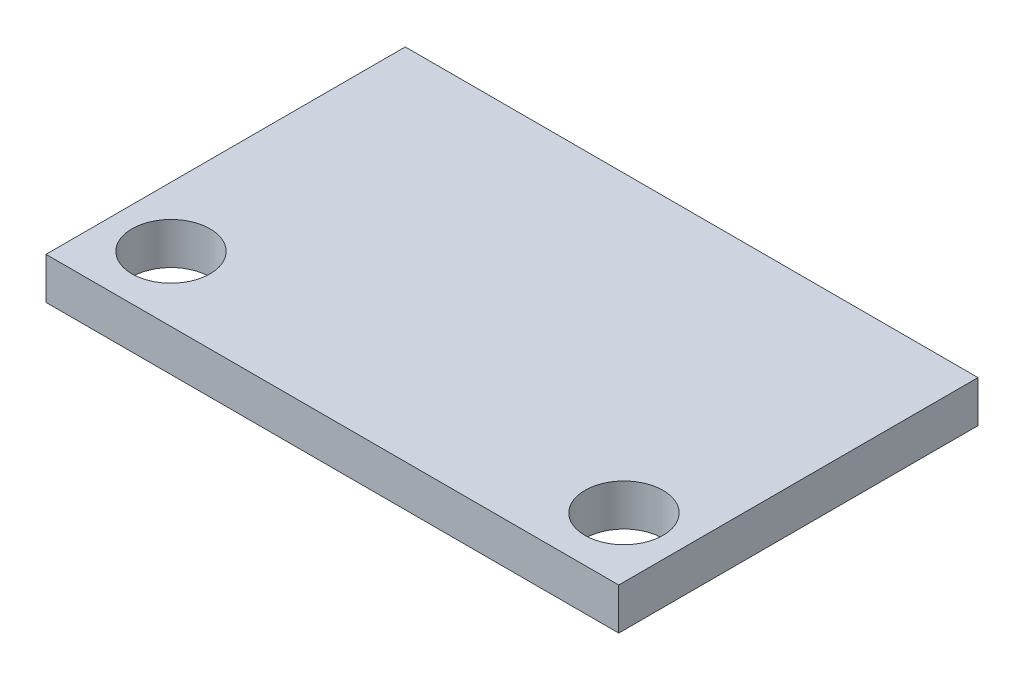
ISO-10303-21;
HEADER;
FILE_DESCRIPTION(('STEP AP214'),'2;1');
FILE_NAME('part.step','',(''),(''),'','','');
FILE_SCHEMA(('AUTOMOTIVE_DESIGN { 1 0 10303 214 1 1 1 1 }'));
ENDSEC;
DATA;
#1=APPLICATION_CONTEXT('core data for automotive mechanical design processes');
#2=APPLICATION_PROTOCOL_DEFINITION('international standard','automotive_design',2000,#1);
#3=PRODUCT_CONTEXT('',#1,'mechanical');
#4=PRODUCT('Part','Part','',(#3));
#5=PRODUCT_RELATED_PRODUCT_CATEGORY('part','',(#4));
#6=PRODUCT_DEFINITION_FORMATION('','',#4);
#7=PRODUCT_DEFINITION_CONTEXT('part definition',#1,'design');
#8=PRODUCT_DEFINITION('design','',#6,#7);
#9=PRODUCT_DEFINITION_SHAPE('','',#8);
#10=(LENGTH_UNIT() NAMED_UNIT(*) SI_UNIT(.MILLI.,.METRE.));
#11=(NAMED_UNIT(*) PLANE_ANGLE_UNIT() SI_UNIT($,.RADIAN.));
#12=(NAMED_UNIT(*) SI_UNIT($,.STERADIAN.) SOLID_ANGLE_UNIT());
#13=UNCERTAINTY_MEASURE_WITH_UNIT(LENGTH_MEASURE(1.E-05),#10,'distance_accuracy_value','');
#14=(GEOMETRIC_REPRESENTATION_CONTEXT(3) GLOBAL_UNCERTAINTY_ASSIGNED_CONTEXT((#13)) GLOBAL_UNIT_ASSIGNED_CONTEXT((#10,
#11,#12)) REPRESENTATION_CONTEXT('',''));
#15=CARTESIAN_POINT('',(0.,0.,0.));
#16=DIRECTION('',(0.,0.,1.));
#17=DIRECTION('',(1.,0.,0.));
#18=AXIS2_PLACEMENT_3D('',#15,#16,#17);
#19=CARTESIAN_POINT('',(0.,1.6,0.));
#20=DIRECTION('',(0.,-1.,0.));
#21=DIRECTION('',(0.,0.,-1.));
#22=AXIS2_PLACEMENT_3D('',#19,#20,#21);
#23=PLANE('',#22);
#24=DIRECTION('',(0.,0.,-1.));
#25=VECTOR('',#24,1.);
#26=CARTESIAN_POINT('',(11.,1.6,6.9));
#27=LINE('',#26,#25);
#28=CARTESIAN_POINT('',(11.,1.6,6.9));
#29=VERTEX_POINT('',#28);
#30=CARTESIAN_POINT('',(11.,1.6,-6.9));
#31=VERTEX_POINT('',#30);
#32=EDGE_CURVE('E85',#29,#31,#27,.T.);
#33=ORIENTED_EDGE('',*,*,#32,.T.);
#34=DIRECTION('',(-1.,0.,0.));
#35=VECTOR('',#34,1.);
#36=CARTESIAN_POINT('',(-11.,1.6,-6.9));
#37=LINE('',#36,#35);
#38=CARTESIAN_POINT('',(-11.,1.6,-6.9));
#39=VERTEX_POINT('',#38);
#40=EDGE_CURVE('E80',#31,#39,#37,.T.);
#41=ORIENTED_EDGE('',*,*,#40,.T.);
#42=DIRECTION('',(0.,0.,1.));
#43=VECTOR('',#42,1.);
#44=CARTESIAN_POINT('',(-11.,1.6,6.9));
#45=LINE('',#44,#43);
#46=CARTESIAN_POINT('',(-11.,1.6,6.9));
#47=VERTEX_POINT('',#46);
#48=EDGE_CURVE('E83',#39,#47,#45,.T.);
#49=ORIENTED_EDGE('',*,*,#48,.T.);
#50=DIRECTION('',(1.,0.,0.));
#51=VECTOR('',#50,1.);
#52=CARTESIAN_POINT('',(-11.,1.6,6.9));
#53=LINE('',#52,#51);
#54=EDGE_CURVE('E50',#47,#29,#53,.T.);
#55=ORIENTED_EDGE('',*,*,#54,.T.);
#56=EDGE_LOOP('',(#33,#41,#49,#55));
#57=FACE_BOUND('',#56,.T.);
#58=CARTESIAN_POINT('',(-8.7,1.6,4.4));
#59=DIRECTION('',(0.,1.,0.));
#60=DIRECTION('',(0.,0.,1.));
#61=AXIS2_PLACEMENT_3D('',#58,#59,#60);
#62=CIRCLE('',#61,1.5);
#63=CARTESIAN_POINT('',(-8.7,1.6,5.9));
#64=VERTEX_POINT('',#63);
#65=EDGE_CURVE('E100',#64,#64,#62,.T.);
#66=ORIENTED_EDGE('',*,*,#65,.F.);
#67=EDGE_LOOP('',(#66));
#68=FACE_BOUND('',#67,.T.);
#69=CARTESIAN_POINT('',(8.7,1.6,4.4));
#70=DIRECTION('',(0.,1.,0.));
#71=DIRECTION('',(0.,0.,1.));
#72=AXIS2_PLACEMENT_3D('',#69,#70,#71);
#73=CIRCLE('',#72,1.5);
#74=CARTESIAN_POINT('',(8.7,1.6,5.9));
#75=VERTEX_POINT('',#74);
#76=EDGE_CURVE('E115',#75,#75,#73,.T.);
#77=ORIENTED_EDGE('',*,*,#76,.F.);
#78=EDGE_LOOP('',(#77));
#79=FACE_BOUND('',#78,.T.);
#80=ADVANCED_FACE('F33',(#57,#68,#79),#23,.F.);
#81=CARTESIAN_POINT('',(0.,0.,0.));
#82=DIRECTION('',(0.,-1.,0.));
#83=DIRECTION('',(0.,0.,-1.));
#84=AXIS2_PLACEMENT_3D('',#81,#82,#83);
#85=PLANE('',#84);
#86=CARTESIAN_POINT('',(-8.7,0.,4.4));
#87=DIRECTION('',(0.,1.,0.));
#88=DIRECTION('',(0.,0.,1.));
#89=AXIS2_PLACEMENT_3D('',#86,#87,#88);
#90=CIRCLE('',#89,1.5);
#91=CARTESIAN_POINT('',(-8.7,0.,5.9));
#92=VERTEX_POINT('',#91);
#93=EDGE_CURVE('E112',#92,#92,#90,.T.);
#94=ORIENTED_EDGE('',*,*,#93,.T.);
#95=EDGE_LOOP('',(#94));
#96=FACE_BOUND('',#95,.T.);
#97=DIRECTION('',(0.,0.,-1.));
#98=VECTOR('',#97,1.);
#99=CARTESIAN_POINT('',(11.,0.,6.9));
#100=LINE('',#99,#98);
#101=CARTESIAN_POINT('',(11.,0.,6.9));
#102=VERTEX_POINT('',#101);
#103=CARTESIAN_POINT('',(11.,0.,-6.9));
#104=VERTEX_POINT('',#103);
#105=EDGE_CURVE('E97',#102,#104,#100,.T.);
#106=ORIENTED_EDGE('',*,*,#105,.F.);
#107=DIRECTION('',(1.,0.,0.));
#108=VECTOR('',#107,1.);
#109=CARTESIAN_POINT('',(-11.,0.,6.9));
#110=LINE('',#109,#108);
#111=CARTESIAN_POINT('',(-11.,0.,6.9));
#112=VERTEX_POINT('',#111);
#113=EDGE_CURVE('E73',#112,#102,#110,.T.);
#114=ORIENTED_EDGE('',*,*,#113,.F.);
#115=DIRECTION('',(0.,0.,1.));
#116=VECTOR('',#115,1.);
#117=CARTESIAN_POINT('',(-11.,0.,6.9));
#118=LINE('',#117,#116);
#119=CARTESIAN_POINT('',(-11.,0.,-6.9));
#120=VERTEX_POINT('',#119);
#121=EDGE_CURVE('E67',#120,#112,#118,.T.);
#122=ORIENTED_EDGE('',*,*,#121,.F.);
#123=DIRECTION('',(-1.,0.,0.));
#124=VECTOR('',#123,1.);
#125=CARTESIAN_POINT('',(-11.,0.,-6.9));
#126=LINE('',#125,#124);
#127=EDGE_CURVE('E89',#104,#120,#126,.T.);
#128=ORIENTED_EDGE('',*,*,#127,.F.);
#129=EDGE_LOOP('',(#106,#114,#122,#128));
#130=FACE_BOUND('',#129,.T.);
#131=CARTESIAN_POINT('',(8.7,0.,4.4));
#132=DIRECTION('',(0.,1.,0.));
#133=DIRECTION('',(0.,0.,1.));
#134=AXIS2_PLACEMENT_3D('',#131,#132,#133);
#135=CIRCLE('',#134,1.5);
#136=CARTESIAN_POINT('',(8.7,0.,5.9));
#137=VERTEX_POINT('',#136);
#138=EDGE_CURVE('E118',#137,#137,#135,.T.);
#139=ORIENTED_EDGE('',*,*,#138,.T.);
#140=EDGE_LOOP('',(#139));
#141=FACE_BOUND('',#140,.T.);
#142=ADVANCED_FACE('F108',(#96,#130,#141),#85,.T.);
#143=CARTESIAN_POINT('',(11.,1.6,6.9));
#144=DIRECTION('',(-1.,0.,0.));
#145=DIRECTION('',(0.,0.,1.));
#146=AXIS2_PLACEMENT_3D('',#143,#144,#145);
#147=PLANE('',#146);
#148=ORIENTED_EDGE('',*,*,#105,.T.);
#149=DIRECTION('',(0.,-1.,0.));
#150=VECTOR('',#149,1.);
#151=CARTESIAN_POINT('',(11.,1.6,-6.9));
#152=LINE('',#151,#150);
#153=EDGE_CURVE('E11',#31,#104,#152,.T.);
#154=ORIENTED_EDGE('',*,*,#153,.F.);
#155=ORIENTED_EDGE('',*,*,#32,.F.);
#156=DIRECTION('',(0.,-1.,0.));
#157=VECTOR('',#156,1.);
#158=CARTESIAN_POINT('',(11.,1.6,6.9));
#159=LINE('',#158,#157);
#160=EDGE_CURVE('E93',#29,#102,#159,.T.);
#161=ORIENTED_EDGE('',*,*,#160,.T.);
#162=EDGE_LOOP('',(#148,#154,#155,#161));
#163=FACE_BOUND('',#162,.T.);
#164=ADVANCED_FACE('F35',(#163),#147,.F.);
#165=CARTESIAN_POINT('',(-11.,1.6,-6.9));
#166=DIRECTION('',(0.,0.,1.));
#167=DIRECTION('',(1.,0.,0.));
#168=AXIS2_PLACEMENT_3D('',#165,#166,#167);
#169=PLANE('',#168);
#170=ORIENTED_EDGE('',*,*,#127,.T.);
#171=DIRECTION('',(0.,-1.,0.));
#172=VECTOR('',#171,1.);
#173=CARTESIAN_POINT('',(-11.,1.6,-6.9));
#174=LINE('',#173,#172);
#175=EDGE_CURVE('E42',#39,#120,#174,.T.);
#176=ORIENTED_EDGE('',*,*,#175,.F.);
#177=ORIENTED_EDGE('',*,*,#40,.F.);
#178=ORIENTED_EDGE('',*,*,#153,.T.);
#179=EDGE_LOOP('',(#170,#176,#177,#178));
#180=FACE_BOUND('',#179,.T.);
#181=ADVANCED_FACE('F88',(#180),#169,.F.);
#182=CARTESIAN_POINT('',(-11.,1.6,6.9));
#183=DIRECTION('',(1.,0.,0.));
#184=DIRECTION('',(0.,0.,-1.));
#185=AXIS2_PLACEMENT_3D('',#182,#183,#184);
#186=PLANE('',#185);
#187=ORIENTED_EDGE('',*,*,#121,.T.);
#188=DIRECTION('',(0.,-1.,0.));
#189=VECTOR('',#188,1.);
#190=CARTESIAN_POINT('',(-11.,1.6,6.9));
#191=LINE('',#190,#189);
#192=EDGE_CURVE('E90',#47,#112,#191,.T.);
#193=ORIENTED_EDGE('',*,*,#192,.F.);
#194=ORIENTED_EDGE('',*,*,#48,.F.);
#195=ORIENTED_EDGE('',*,*,#175,.T.);
#196=EDGE_LOOP('',(#187,#193,#194,#195));
#197=FACE_BOUND('',#196,.T.);
#198=ADVANCED_FACE('F91',(#197),#186,.F.);
#199=CARTESIAN_POINT('',(-11.,1.6,6.9));
#200=DIRECTION('',(0.,0.,-1.));
#201=DIRECTION('',(-1.,0.,0.));
#202=AXIS2_PLACEMENT_3D('',#199,#200,#201);
#203=PLANE('',#202);
#204=ORIENTED_EDGE('',*,*,#113,.T.);
#205=ORIENTED_EDGE('',*,*,#160,.F.);
#206=ORIENTED_EDGE('',*,*,#54,.F.);
#207=ORIENTED_EDGE('',*,*,#192,.T.);
#208=EDGE_LOOP('',(#204,#205,#206,#207));
#209=FACE_BOUND('',#208,.T.);
#210=ADVANCED_FACE('F105',(#209),#203,.F.);
#211=CARTESIAN_POINT('',(-8.7,1.6,4.4));
#212=DIRECTION('',(0.,-1.,0.));
#213=DIRECTION('',(0.,0.,-1.));
#214=AXIS2_PLACEMENT_3D('',#211,#212,#213);
#215=CYLINDRICAL_SURFACE('',#214,1.5);
#216=ORIENTED_EDGE('',*,*,#65,.T.);
#217=EDGE_LOOP('',(#216));
#218=FACE_BOUND('',#217,.T.);
#219=ORIENTED_EDGE('',*,*,#93,.F.);
#220=EDGE_LOOP('',(#219));
#221=FACE_BOUND('',#220,.T.);
#222=ADVANCED_FACE('F135',(#218,#221),#215,.F.);
#223=CARTESIAN_POINT('',(8.7,1.6,4.4));
#224=DIRECTION('',(0.,-1.,0.));
#225=DIRECTION('',(0.,0.,-1.));
#226=AXIS2_PLACEMENT_3D('',#223,#224,#225);
#227=CYLINDRICAL_SURFACE('',#226,1.5);
#228=ORIENTED_EDGE('',*,*,#76,.T.);
#229=EDGE_LOOP('',(#228));
#230=FACE_BOUND('',#229,.T.);
#231=ORIENTED_EDGE('',*,*,#138,.F.);
#232=EDGE_LOOP('',(#231));
#233=FACE_BOUND('',#232,.T.);
#234=ADVANCED_FACE('F124',(#230,#233),#227,.F.);
#235=CLOSED_SHELL('',(#80,#142,#164,#181,#198,#210,#222,#234));
#236=MANIFOLD_SOLID_BREP('B2',#235);
#237=ADVANCED_BREP_SHAPE_REPRESENTATION('',(#18,#236),#14);
#238=SHAPE_DEFINITION_REPRESENTATION(#9,#237);
ENDSEC;
END-ISO-10303-21;
